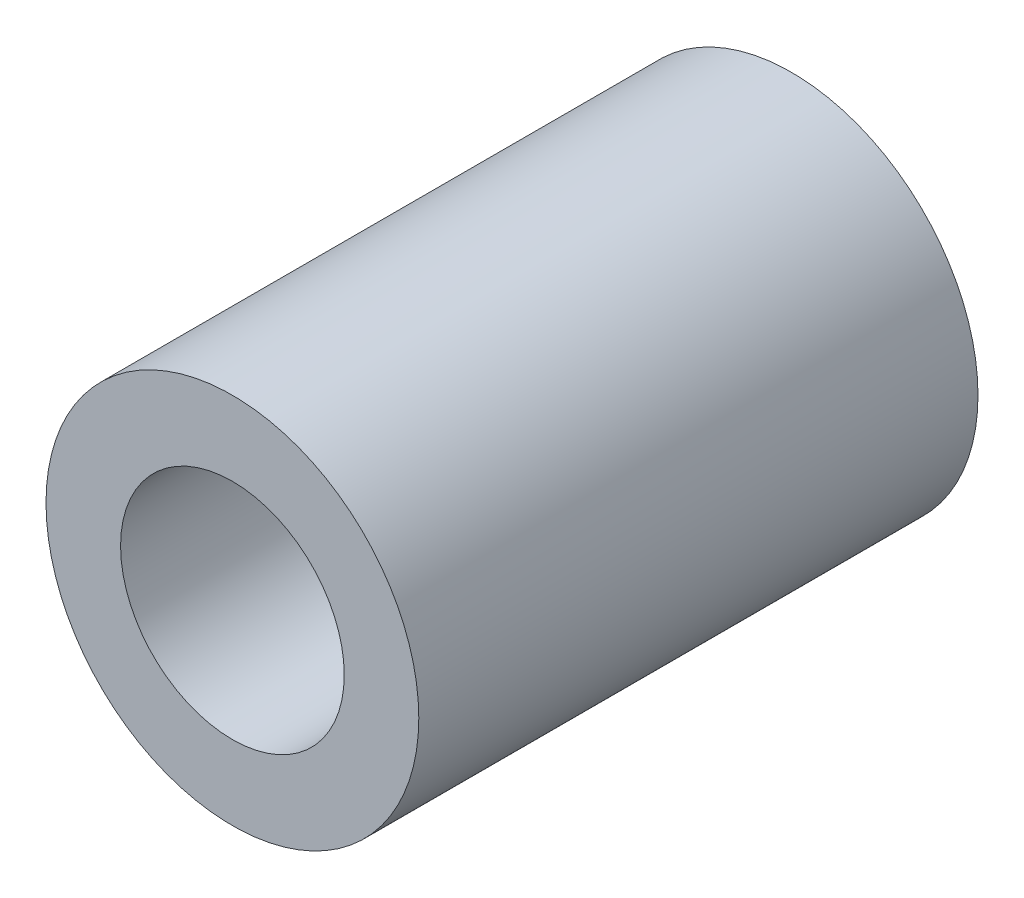
ISO-10303-21;
HEADER;
FILE_DESCRIPTION(('STEP AP214'),'2;1');
FILE_NAME('part.step','',(''),(''),'','','');
FILE_SCHEMA(('AUTOMOTIVE_DESIGN { 1 0 10303 214 1 1 1 1 }'));
ENDSEC;
DATA;
#1=APPLICATION_CONTEXT('core data for automotive mechanical design processes');
#2=APPLICATION_PROTOCOL_DEFINITION('international standard','automotive_design',2000,#1);
#3=PRODUCT_CONTEXT('',#1,'mechanical');
#4=PRODUCT('Part','Part','',(#3));
#5=PRODUCT_RELATED_PRODUCT_CATEGORY('part','',(#4));
#6=PRODUCT_DEFINITION_FORMATION('','',#4);
#7=PRODUCT_DEFINITION_CONTEXT('part definition',#1,'design');
#8=PRODUCT_DEFINITION('design','',#6,#7);
#9=PRODUCT_DEFINITION_SHAPE('','',#8);
#10=(LENGTH_UNIT() NAMED_UNIT(*) SI_UNIT(.MILLI.,.METRE.));
#11=(NAMED_UNIT(*) PLANE_ANGLE_UNIT() SI_UNIT($,.RADIAN.));
#12=(NAMED_UNIT(*) SI_UNIT($,.STERADIAN.) SOLID_ANGLE_UNIT());
#13=UNCERTAINTY_MEASURE_WITH_UNIT(LENGTH_MEASURE(1.E-05),#10,'distance_accuracy_value','');
#14=(GEOMETRIC_REPRESENTATION_CONTEXT(3) GLOBAL_UNCERTAINTY_ASSIGNED_CONTEXT((#13)) GLOBAL_UNIT_ASSIGNED_CONTEXT((#10,
#11,#12)) REPRESENTATION_CONTEXT('',''));
#15=CARTESIAN_POINT('',(0.,0.,0.));
#16=DIRECTION('',(0.,0.,1.));
#17=DIRECTION('',(1.,0.,0.));
#18=AXIS2_PLACEMENT_3D('',#15,#16,#17);
#19=CARTESIAN_POINT('',(0.,0.,7.5));
#20=DIRECTION('',(0.,0.,1.));
#21=DIRECTION('',(1.,0.,0.));
#22=AXIS2_PLACEMENT_3D('',#19,#20,#21);
#23=PLANE('',#22);
#24=CARTESIAN_POINT('',(0.,0.,7.5));
#25=DIRECTION('',(0.,0.,1.));
#26=DIRECTION('',(1.,0.,0.));
#27=AXIS2_PLACEMENT_3D('',#24,#25,#26);
#28=CIRCLE('',#27,2.5);
#29=CARTESIAN_POINT('',(2.5,0.,7.5));
#30=VERTEX_POINT('',#29);
#31=EDGE_CURVE('E10',#30,#30,#28,.T.);
#32=ORIENTED_EDGE('',*,*,#31,.T.);
#33=EDGE_LOOP('',(#32));
#34=FACE_BOUND('',#33,.T.);
#35=CARTESIAN_POINT('',(0.,0.,7.5));
#36=DIRECTION('',(0.,0.,1.));
#37=DIRECTION('',(1.,0.,0.));
#38=AXIS2_PLACEMENT_3D('',#35,#36,#37);
#39=CIRCLE('',#38,1.5);
#40=CARTESIAN_POINT('',(1.5,0.,7.5));
#41=VERTEX_POINT('',#40);
#42=EDGE_CURVE('E46',#41,#41,#39,.T.);
#43=ORIENTED_EDGE('',*,*,#42,.F.);
#44=EDGE_LOOP('',(#43));
#45=FACE_BOUND('',#44,.T.);
#46=ADVANCED_FACE('F35',(#34,#45),#23,.T.);
#47=CARTESIAN_POINT('',(0.,0.,0.));
#48=DIRECTION('',(0.,0.,1.));
#49=DIRECTION('',(1.,0.,0.));
#50=AXIS2_PLACEMENT_3D('',#47,#48,#49);
#51=PLANE('',#50);
#52=CARTESIAN_POINT('',(0.,0.,0.));
#53=DIRECTION('',(0.,0.,1.));
#54=DIRECTION('',(1.,0.,0.));
#55=AXIS2_PLACEMENT_3D('',#52,#53,#54);
#56=CIRCLE('',#55,2.5);
#57=CARTESIAN_POINT('',(2.5,0.,0.));
#58=VERTEX_POINT('',#57);
#59=EDGE_CURVE('E39',#58,#58,#56,.T.);
#60=ORIENTED_EDGE('',*,*,#59,.F.);
#61=EDGE_LOOP('',(#60));
#62=FACE_BOUND('',#61,.T.);
#63=CARTESIAN_POINT('',(0.,0.,0.));
#64=DIRECTION('',(0.,0.,1.));
#65=DIRECTION('',(1.,0.,0.));
#66=AXIS2_PLACEMENT_3D('',#63,#64,#65);
#67=CIRCLE('',#66,1.5);
#68=CARTESIAN_POINT('',(1.5,0.,0.));
#69=VERTEX_POINT('',#68);
#70=EDGE_CURVE('E48',#69,#69,#67,.T.);
#71=ORIENTED_EDGE('',*,*,#70,.T.);
#72=EDGE_LOOP('',(#71));
#73=FACE_BOUND('',#72,.T.);
#74=ADVANCED_FACE('F58',(#62,#73),#51,.F.);
#75=CARTESIAN_POINT('',(0.,0.,7.5));
#76=DIRECTION('',(0.,0.,-1.));
#77=DIRECTION('',(-1.,0.,0.));
#78=AXIS2_PLACEMENT_3D('',#75,#76,#77);
#79=CYLINDRICAL_SURFACE('',#78,2.5);
#80=ORIENTED_EDGE('',*,*,#31,.F.);
#81=EDGE_LOOP('',(#80));
#82=FACE_BOUND('',#81,.T.);
#83=ORIENTED_EDGE('',*,*,#59,.T.);
#84=EDGE_LOOP('',(#83));
#85=FACE_BOUND('',#84,.T.);
#86=ADVANCED_FACE('F37',(#82,#85),#79,.T.);
#87=CARTESIAN_POINT('',(0.,0.,7.5));
#88=DIRECTION('',(0.,0.,-1.));
#89=DIRECTION('',(-1.,0.,0.));
#90=AXIS2_PLACEMENT_3D('',#87,#88,#89);
#91=CYLINDRICAL_SURFACE('',#90,1.5);
#92=ORIENTED_EDGE('',*,*,#42,.T.);
#93=EDGE_LOOP('',(#92));
#94=FACE_BOUND('',#93,.T.);
#95=ORIENTED_EDGE('',*,*,#70,.F.);
#96=EDGE_LOOP('',(#95));
#97=FACE_BOUND('',#96,.T.);
#98=ADVANCED_FACE('F54',(#94,#97),#91,.F.);
#99=CLOSED_SHELL('',(#46,#74,#86,#98));
#100=MANIFOLD_SOLID_BREP('B2',#99);
#101=ADVANCED_BREP_SHAPE_REPRESENTATION('',(#18,#100),#14);
#102=SHAPE_DEFINITION_REPRESENTATION(#9,#101);
ENDSEC;
END-ISO-10303-21;
